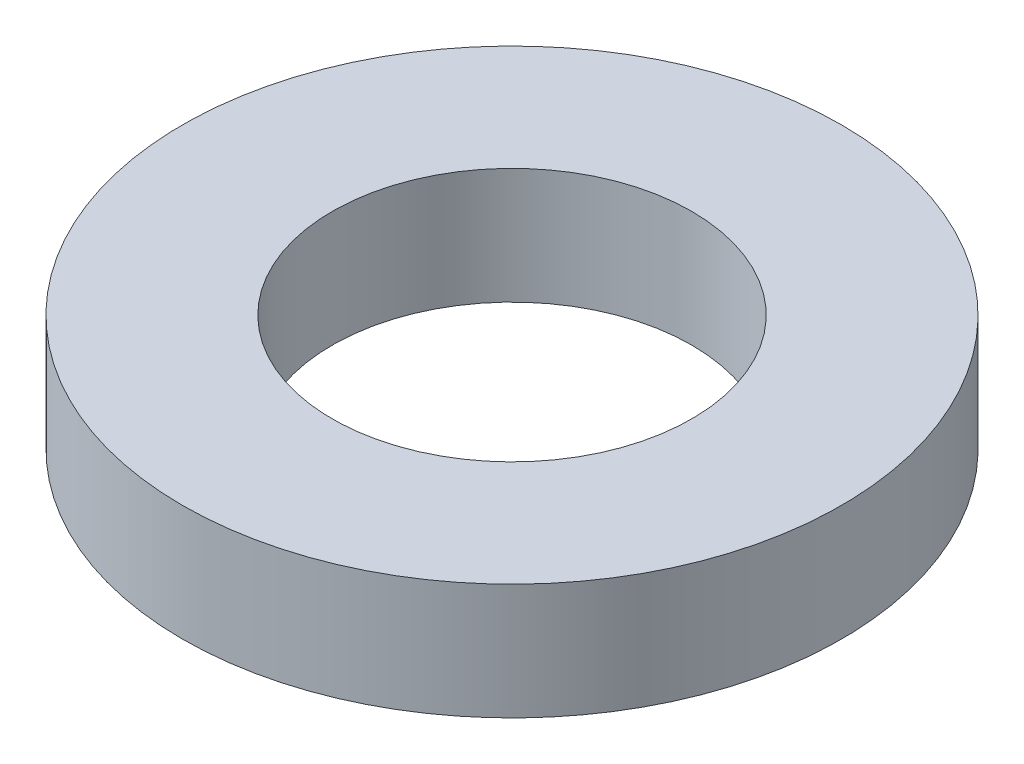
ISO-10303-21;
HEADER;
FILE_DESCRIPTION(('STEP AP214'),'2;1');
FILE_NAME('part.step','',(''),(''),'','','');
FILE_SCHEMA(('AUTOMOTIVE_DESIGN { 1 0 10303 214 1 1 1 1 }'));
ENDSEC;
DATA;
#1=APPLICATION_CONTEXT('core data for automotive mechanical design processes');
#2=APPLICATION_PROTOCOL_DEFINITION('international standard','automotive_design',2000,#1);
#3=PRODUCT_CONTEXT('',#1,'mechanical');
#4=PRODUCT('Part','Part','',(#3));
#5=PRODUCT_RELATED_PRODUCT_CATEGORY('part','',(#4));
#6=PRODUCT_DEFINITION_FORMATION('','',#4);
#7=PRODUCT_DEFINITION_CONTEXT('part definition',#1,'design');
#8=PRODUCT_DEFINITION('design','',#6,#7);
#9=PRODUCT_DEFINITION_SHAPE('','',#8);
#10=(LENGTH_UNIT() NAMED_UNIT(*) SI_UNIT(.MILLI.,.METRE.));
#11=(NAMED_UNIT(*) PLANE_ANGLE_UNIT() SI_UNIT($,.RADIAN.));
#12=(NAMED_UNIT(*) SI_UNIT($,.STERADIAN.) SOLID_ANGLE_UNIT());
#13=UNCERTAINTY_MEASURE_WITH_UNIT(LENGTH_MEASURE(1.E-05),#10,'distance_accuracy_value','');
#14=(GEOMETRIC_REPRESENTATION_CONTEXT(3) GLOBAL_UNCERTAINTY_ASSIGNED_CONTEXT((#13)) GLOBAL_UNIT_ASSIGNED_CONTEXT((#10,
#11,#12)) REPRESENTATION_CONTEXT('',''));
#15=CARTESIAN_POINT('',(0.,0.,0.));
#16=DIRECTION('',(0.,0.,1.));
#17=DIRECTION('',(1.,0.,0.));
#18=AXIS2_PLACEMENT_3D('',#15,#16,#17);
#19=CARTESIAN_POINT('',(0.,29.,0.));
#20=DIRECTION('',(0.,-1.,0.));
#21=DIRECTION('',(0.,0.,-1.));
#22=AXIS2_PLACEMENT_3D('',#19,#20,#21);
#23=CYLINDRICAL_SURFACE('',#22,82.5);
#24=CARTESIAN_POINT('',(0.,29.,0.));
#25=DIRECTION('',(0.,1.,0.));
#26=DIRECTION('',(0.,0.,1.));
#27=AXIS2_PLACEMENT_3D('',#24,#25,#26);
#28=CIRCLE('',#27,82.5);
#29=CARTESIAN_POINT('',(0.,29.,-82.5));
#30=VERTEX_POINT('',#29);
#31=EDGE_CURVE('E10',#30,#30,#28,.T.);
#32=CARTESIAN_POINT('',(0.,0.,0.));
#33=DIRECTION('',(0.,1.,0.));
#34=DIRECTION('',(0.,0.,1.));
#35=AXIS2_PLACEMENT_3D('',#32,#33,#34);
#36=CIRCLE('',#35,82.5);
#37=CARTESIAN_POINT('',(0.,0.,-82.5));
#38=VERTEX_POINT('',#37);
#39=EDGE_CURVE('E37',#38,#38,#36,.T.);
#40=CARTESIAN_POINT('',(0.,29.,-82.5));
#41=CARTESIAN_POINT('',(0.,28.6979166666667,-82.5));
#42=CARTESIAN_POINT('',(0.,28.3958333333333,-82.5));
#43=CARTESIAN_POINT('',(0.,27.7916666666667,-82.5));
#44=CARTESIAN_POINT('',(0.,27.4895833333333,-82.5));
#45=CARTESIAN_POINT('',(0.,26.8854166666667,-82.5));
#46=CARTESIAN_POINT('',(0.,26.5833333333333,-82.5));
#47=CARTESIAN_POINT('',(0.,25.9791666666667,-82.5));
#48=CARTESIAN_POINT('',(0.,25.6770833333333,-82.5));
#49=CARTESIAN_POINT('',(0.,25.0729166666667,-82.5));
#50=CARTESIAN_POINT('',(0.,24.7708333333333,-82.5));
#51=CARTESIAN_POINT('',(0.,24.1666666666667,-82.5));
#52=CARTESIAN_POINT('',(0.,23.8645833333333,-82.5));
#53=CARTESIAN_POINT('',(0.,23.2604166666667,-82.5));
#54=CARTESIAN_POINT('',(0.,22.9583333333333,-82.5));
#55=CARTESIAN_POINT('',(0.,22.3541666666667,-82.5));
#56=CARTESIAN_POINT('',(0.,22.0520833333333,-82.5));
#57=CARTESIAN_POINT('',(0.,21.4479166666667,-82.5));
#58=CARTESIAN_POINT('',(0.,21.1458333333333,-82.5));
#59=CARTESIAN_POINT('',(0.,20.5416666666667,-82.5));
#60=CARTESIAN_POINT('',(0.,20.2395833333333,-82.5));
#61=CARTESIAN_POINT('',(0.,19.6354166666667,-82.5));
#62=CARTESIAN_POINT('',(0.,19.3333333333333,-82.5));
#63=CARTESIAN_POINT('',(0.,18.7291666666667,-82.5));
#64=CARTESIAN_POINT('',(0.,18.4270833333333,-82.5));
#65=CARTESIAN_POINT('',(0.,17.8229166666667,-82.5));
#66=CARTESIAN_POINT('',(0.,17.5208333333333,-82.5));
#67=CARTESIAN_POINT('',(0.,16.9166666666667,-82.5));
#68=CARTESIAN_POINT('',(0.,16.6145833333333,-82.5));
#69=CARTESIAN_POINT('',(0.,16.0104166666667,-82.5));
#70=CARTESIAN_POINT('',(0.,15.7083333333333,-82.5));
#71=CARTESIAN_POINT('',(0.,15.1041666666667,-82.5));
#72=CARTESIAN_POINT('',(0.,14.8020833333333,-82.5));
#73=CARTESIAN_POINT('',(0.,14.1979166666667,-82.5));
#74=CARTESIAN_POINT('',(0.,13.8958333333333,-82.5));
#75=CARTESIAN_POINT('',(0.,13.2916666666667,-82.5));
#76=CARTESIAN_POINT('',(0.,12.9895833333333,-82.5));
#77=CARTESIAN_POINT('',(0.,12.3854166666667,-82.5));
#78=CARTESIAN_POINT('',(0.,12.0833333333333,-82.5));
#79=CARTESIAN_POINT('',(0.,11.4791666666667,-82.5));
#80=CARTESIAN_POINT('',(0.,11.1770833333333,-82.5));
#81=CARTESIAN_POINT('',(0.,10.5729166666667,-82.5));
#82=CARTESIAN_POINT('',(0.,10.2708333333333,-82.5));
#83=CARTESIAN_POINT('',(0.,9.66666666666667,-82.5));
#84=CARTESIAN_POINT('',(0.,9.36458333333333,-82.5));
#85=CARTESIAN_POINT('',(0.,8.76041666666667,-82.5));
#86=CARTESIAN_POINT('',(0.,8.45833333333333,-82.5));
#87=CARTESIAN_POINT('',(0.,7.85416666666667,-82.5));
#88=CARTESIAN_POINT('',(0.,7.55208333333333,-82.5));
#89=CARTESIAN_POINT('',(0.,6.94791666666667,-82.5));
#90=CARTESIAN_POINT('',(0.,6.64583333333333,-82.5));
#91=CARTESIAN_POINT('',(0.,6.04166666666667,-82.5));
#92=CARTESIAN_POINT('',(0.,5.73958333333333,-82.5));
#93=CARTESIAN_POINT('',(0.,5.13541666666667,-82.5));
#94=CARTESIAN_POINT('',(0.,4.83333333333333,-82.5));
#95=CARTESIAN_POINT('',(0.,4.22916666666667,-82.5));
#96=CARTESIAN_POINT('',(0.,3.92708333333333,-82.5));
#97=CARTESIAN_POINT('',(0.,3.32291666666667,-82.5));
#98=CARTESIAN_POINT('',(0.,3.02083333333333,-82.5));
#99=CARTESIAN_POINT('',(0.,2.41666666666667,-82.5));
#100=CARTESIAN_POINT('',(0.,2.11458333333333,-82.5));
#101=CARTESIAN_POINT('',(0.,1.51041666666667,-82.5));
#102=CARTESIAN_POINT('',(0.,1.20833333333333,-82.5));
#103=CARTESIAN_POINT('',(0.,0.604166666666667,-82.5));
#104=CARTESIAN_POINT('',(0.,0.302083333333333,-82.5));
#105=CARTESIAN_POINT('',(0.,0.,-82.5));
#106=B_SPLINE_CURVE_WITH_KNOTS('',3,(#40,#41,#42,#43,#44,#45,#46,#47,#48,#49,#50,#51,#52,#53,
#54,#55,#56,#57,#58,#59,#60,#61,#62,#63,#64,#65,#66,#67,#68,#69,#70,#71,#72,#73,#74,#75,#76,#77,
#78,#79,#80,#81,#82,#83,#84,#85,#86,#87,#88,#89,#90,#91,#92,#93,#94,#95,#96,#97,#98,#99,#100,
#101,#102,#103,#104,#105),.UNSPECIFIED.,.F.,.F.,(4,2,2,2,2,2,2,2,2,2,2,2,2,2,2,2,2,2,2,2,2,2,2,
2,2,2,2,2,2,2,2,2,4),(0.,0.906249999999997,1.8125,2.71875,3.625,4.53125,5.4375,6.34375,7.25,
8.15625,9.0625,9.96875,10.875,11.78125,12.6875,13.59375,14.5,15.40625,16.3125,17.21875,18.125,
19.03125,19.9375,20.84375,21.75,22.65625,23.5625,24.46875,25.375,26.28125,27.1875,28.09375,29.),.UNSPECIFIED.);
#107=EDGE_CURVE('BSEAM40',#30,#38,#106,.T.);
#108=ORIENTED_EDGE('',*,*,#31,.F.);
#109=ORIENTED_EDGE('',*,*,#39,.T.);
#110=ORIENTED_EDGE('',*,*,#107,.T.);
#111=ORIENTED_EDGE('',*,*,#107,.F.);
#112=EDGE_LOOP('',(#108,#110,#109,#111));
#113=FACE_BOUND('',#112,.T.);
#114=ADVANCED_FACE('F40',(#113),#23,.T.);
#115=CARTESIAN_POINT('',(0.,29.,0.));
#116=DIRECTION('',(0.,1.,0.));
#117=DIRECTION('',(0.,0.,1.));
#118=AXIS2_PLACEMENT_3D('',#115,#116,#117);
#119=PLANE('',#118);
#120=CARTESIAN_POINT('',(0.,29.,0.));
#121=DIRECTION('',(0.,1.,0.));
#122=DIRECTION('',(0.,0.,1.));
#123=AXIS2_PLACEMENT_3D('',#120,#121,#122);
#124=CIRCLE('',#123,45.);
#125=CARTESIAN_POINT('',(0.,29.,-45.));
#126=VERTEX_POINT('',#125);
#127=EDGE_CURVE('E50',#126,#126,#124,.T.);
#128=ORIENTED_EDGE('',*,*,#127,.F.);
#129=EDGE_LOOP('',(#128));
#130=FACE_BOUND('',#129,.T.);
#131=ORIENTED_EDGE('',*,*,#31,.T.);
#132=EDGE_LOOP('',(#131));
#133=FACE_BOUND('',#132,.T.);
#134=ADVANCED_FACE('F59',(#130,#133),#119,.T.);
#135=CARTESIAN_POINT('',(0.,0.,0.));
#136=DIRECTION('',(0.,1.,0.));
#137=DIRECTION('',(0.,0.,1.));
#138=AXIS2_PLACEMENT_3D('',#135,#136,#137);
#139=PLANE('',#138);
#140=CARTESIAN_POINT('',(0.,0.,0.));
#141=DIRECTION('',(0.,1.,0.));
#142=DIRECTION('',(0.,0.,1.));
#143=AXIS2_PLACEMENT_3D('',#140,#141,#142);
#144=CIRCLE('',#143,45.);
#145=CARTESIAN_POINT('',(0.,0.,-45.));
#146=VERTEX_POINT('',#145);
#147=EDGE_CURVE('E47',#146,#146,#144,.T.);
#148=ORIENTED_EDGE('',*,*,#147,.T.);
#149=EDGE_LOOP('',(#148));
#150=FACE_BOUND('',#149,.T.);
#151=ORIENTED_EDGE('',*,*,#39,.F.);
#152=EDGE_LOOP('',(#151));
#153=FACE_BOUND('',#152,.T.);
#154=ADVANCED_FACE('F58',(#150,#153),#139,.F.);
#155=CARTESIAN_POINT('',(0.,29.,0.));
#156=DIRECTION('',(0.,-1.,0.));
#157=DIRECTION('',(0.,0.,-1.));
#158=AXIS2_PLACEMENT_3D('',#155,#156,#157);
#159=CYLINDRICAL_SURFACE('',#158,45.);
#160=CARTESIAN_POINT('',(0.,29.,-45.));
#161=CARTESIAN_POINT('',(0.,28.6979166666667,-45.));
#162=CARTESIAN_POINT('',(0.,28.3958333333333,-45.));
#163=CARTESIAN_POINT('',(0.,27.7916666666667,-45.));
#164=CARTESIAN_POINT('',(0.,27.4895833333333,-45.));
#165=CARTESIAN_POINT('',(0.,26.8854166666667,-45.));
#166=CARTESIAN_POINT('',(0.,26.5833333333333,-45.));
#167=CARTESIAN_POINT('',(0.,25.9791666666667,-45.));
#168=CARTESIAN_POINT('',(0.,25.6770833333333,-45.));
#169=CARTESIAN_POINT('',(0.,25.0729166666667,-45.));
#170=CARTESIAN_POINT('',(0.,24.7708333333333,-45.));
#171=CARTESIAN_POINT('',(0.,24.1666666666667,-45.));
#172=CARTESIAN_POINT('',(0.,23.8645833333333,-45.));
#173=CARTESIAN_POINT('',(0.,23.2604166666667,-45.));
#174=CARTESIAN_POINT('',(0.,22.9583333333333,-45.));
#175=CARTESIAN_POINT('',(0.,22.3541666666667,-45.));
#176=CARTESIAN_POINT('',(0.,22.0520833333333,-45.));
#177=CARTESIAN_POINT('',(0.,21.4479166666667,-45.));
#178=CARTESIAN_POINT('',(0.,21.1458333333333,-45.));
#179=CARTESIAN_POINT('',(0.,20.5416666666667,-45.));
#180=CARTESIAN_POINT('',(0.,20.2395833333333,-45.));
#181=CARTESIAN_POINT('',(0.,19.6354166666667,-45.));
#182=CARTESIAN_POINT('',(0.,19.3333333333333,-45.));
#183=CARTESIAN_POINT('',(0.,18.7291666666667,-45.));
#184=CARTESIAN_POINT('',(0.,18.4270833333333,-45.));
#185=CARTESIAN_POINT('',(0.,17.8229166666667,-45.));
#186=CARTESIAN_POINT('',(0.,17.5208333333333,-45.));
#187=CARTESIAN_POINT('',(0.,16.9166666666667,-45.));
#188=CARTESIAN_POINT('',(0.,16.6145833333333,-45.));
#189=CARTESIAN_POINT('',(0.,16.0104166666667,-45.));
#190=CARTESIAN_POINT('',(0.,15.7083333333333,-45.));
#191=CARTESIAN_POINT('',(0.,15.1041666666667,-45.));
#192=CARTESIAN_POINT('',(0.,14.8020833333333,-45.));
#193=CARTESIAN_POINT('',(0.,14.1979166666667,-45.));
#194=CARTESIAN_POINT('',(0.,13.8958333333333,-45.));
#195=CARTESIAN_POINT('',(0.,13.2916666666667,-45.));
#196=CARTESIAN_POINT('',(0.,12.9895833333333,-45.));
#197=CARTESIAN_POINT('',(0.,12.3854166666667,-45.));
#198=CARTESIAN_POINT('',(0.,12.0833333333333,-45.));
#199=CARTESIAN_POINT('',(0.,11.4791666666667,-45.));
#200=CARTESIAN_POINT('',(0.,11.1770833333333,-45.));
#201=CARTESIAN_POINT('',(0.,10.5729166666667,-45.));
#202=CARTESIAN_POINT('',(0.,10.2708333333333,-45.));
#203=CARTESIAN_POINT('',(0.,9.66666666666667,-45.));
#204=CARTESIAN_POINT('',(0.,9.36458333333333,-45.));
#205=CARTESIAN_POINT('',(0.,8.76041666666667,-45.));
#206=CARTESIAN_POINT('',(0.,8.45833333333333,-45.));
#207=CARTESIAN_POINT('',(0.,7.85416666666667,-45.));
#208=CARTESIAN_POINT('',(0.,7.55208333333333,-45.));
#209=CARTESIAN_POINT('',(0.,6.94791666666667,-45.));
#210=CARTESIAN_POINT('',(0.,6.64583333333333,-45.));
#211=CARTESIAN_POINT('',(0.,6.04166666666667,-45.));
#212=CARTESIAN_POINT('',(0.,5.73958333333333,-45.));
#213=CARTESIAN_POINT('',(0.,5.13541666666667,-45.));
#214=CARTESIAN_POINT('',(0.,4.83333333333333,-45.));
#215=CARTESIAN_POINT('',(0.,4.22916666666667,-45.));
#216=CARTESIAN_POINT('',(0.,3.92708333333333,-45.));
#217=CARTESIAN_POINT('',(0.,3.32291666666667,-45.));
#218=CARTESIAN_POINT('',(0.,3.02083333333333,-45.));
#219=CARTESIAN_POINT('',(0.,2.41666666666667,-45.));
#220=CARTESIAN_POINT('',(0.,2.11458333333333,-45.));
#221=CARTESIAN_POINT('',(0.,1.51041666666667,-45.));
#222=CARTESIAN_POINT('',(0.,1.20833333333333,-45.));
#223=CARTESIAN_POINT('',(0.,0.604166666666667,-45.));
#224=CARTESIAN_POINT('',(0.,0.302083333333333,-45.));
#225=CARTESIAN_POINT('',(0.,0.,-45.));
#226=B_SPLINE_CURVE_WITH_KNOTS('',3,(#160,#161,#162,#163,#164,#165,#166,#167,#168,#169,#170,
#171,#172,#173,#174,#175,#176,#177,#178,#179,#180,#181,#182,#183,#184,#185,#186,#187,#188,#189,
#190,#191,#192,#193,#194,#195,#196,#197,#198,#199,#200,#201,#202,#203,#204,#205,#206,#207,#208,
#209,#210,#211,#212,#213,#214,#215,#216,#217,#218,#219,#220,#221,#222,#223,#224,#225),
.UNSPECIFIED.,.F.,.F.,(4,2,2,2,2,2,2,2,2,2,2,2,2,2,2,2,2,2,2,2,2,2,2,2,2,2,2,2,2,2,2,2,4),(0.,
0.906249999999997,1.8125,2.71875,3.625,4.53125,5.4375,6.34375,7.25,8.15625,9.0625,9.96875,
10.875,11.78125,12.6875,13.59375,14.5,15.40625,16.3125,17.21875,18.125,19.03125,19.9375,
20.84375,21.75,22.65625,23.5625,24.46875,25.375,26.28125,27.1875,28.09375,29.),.UNSPECIFIED.);
#227=EDGE_CURVE('BSEAM54',#126,#146,#226,.T.);
#228=ORIENTED_EDGE('',*,*,#127,.T.);
#229=ORIENTED_EDGE('',*,*,#147,.F.);
#230=ORIENTED_EDGE('',*,*,#227,.T.);
#231=ORIENTED_EDGE('',*,*,#227,.F.);
#232=EDGE_LOOP('',(#228,#230,#229,#231));
#233=FACE_BOUND('',#232,.T.);
#234=ADVANCED_FACE('F54',(#233),#159,.F.);
#235=CLOSED_SHELL('',(#114,#134,#154,#234));
#236=MANIFOLD_SOLID_BREP('B2',#235);
#237=ADVANCED_BREP_SHAPE_REPRESENTATION('',(#18,#236),#14);
#238=SHAPE_DEFINITION_REPRESENTATION(#9,#237);
ENDSEC;
END-ISO-10303-21;
